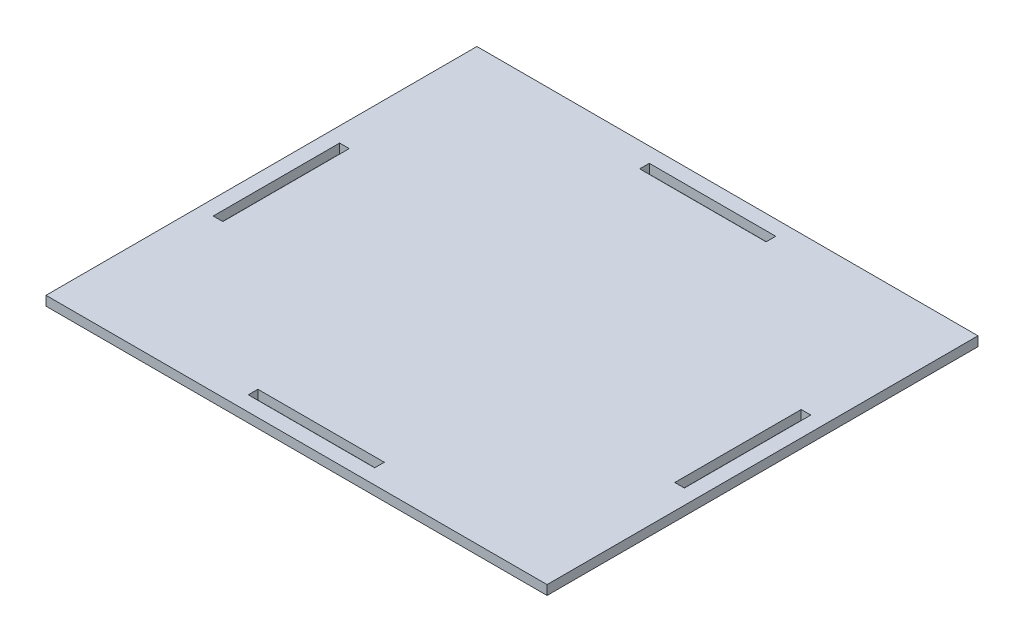
ISO-10303-21;
HEADER;
FILE_DESCRIPTION(('STEP AP214'),'2;1');
FILE_NAME('part.step','',(''),(''),'','','');
FILE_SCHEMA(('AUTOMOTIVE_DESIGN { 1 0 10303 214 1 1 1 1 }'));
ENDSEC;
DATA;
#1=APPLICATION_CONTEXT('core data for automotive mechanical design processes');
#2=APPLICATION_PROTOCOL_DEFINITION('international standard','automotive_design',2000,#1);
#3=PRODUCT_CONTEXT('',#1,'mechanical');
#4=PRODUCT('Part','Part','',(#3));
#5=PRODUCT_RELATED_PRODUCT_CATEGORY('part','',(#4));
#6=PRODUCT_DEFINITION_FORMATION('','',#4);
#7=PRODUCT_DEFINITION_CONTEXT('part definition',#1,'design');
#8=PRODUCT_DEFINITION('design','',#6,#7);
#9=PRODUCT_DEFINITION_SHAPE('','',#8);
#10=(LENGTH_UNIT() NAMED_UNIT(*) SI_UNIT(.MILLI.,.METRE.));
#11=(NAMED_UNIT(*) PLANE_ANGLE_UNIT() SI_UNIT($,.RADIAN.));
#12=(NAMED_UNIT(*) SI_UNIT($,.STERADIAN.) SOLID_ANGLE_UNIT());
#13=UNCERTAINTY_MEASURE_WITH_UNIT(LENGTH_MEASURE(1.E-05),#10,'distance_accuracy_value','');
#14=(GEOMETRIC_REPRESENTATION_CONTEXT(3) GLOBAL_UNCERTAINTY_ASSIGNED_CONTEXT((#13)) GLOBAL_UNIT_ASSIGNED_CONTEXT((#10,
#11,#12)) REPRESENTATION_CONTEXT('',''));
#15=CARTESIAN_POINT('',(0.,0.,0.));
#16=DIRECTION('',(0.,0.,1.));
#17=DIRECTION('',(1.,0.,0.));
#18=AXIS2_PLACEMENT_3D('',#15,#16,#17);
#19=CARTESIAN_POINT('',(79.375,1.4986,68.2625));
#20=DIRECTION('',(-1.,0.,0.));
#21=DIRECTION('',(0.,0.,1.));
#22=AXIS2_PLACEMENT_3D('',#19,#20,#21);
#23=PLANE('',#22);
#24=DIRECTION('',(0.,0.,-1.));
#25=VECTOR('',#24,1.);
#26=CARTESIAN_POINT('',(79.375,-1.4986,68.2625));
#27=LINE('',#26,#25);
#28=CARTESIAN_POINT('',(79.375,-1.4986,68.2625));
#29=VERTEX_POINT('',#28);
#30=CARTESIAN_POINT('',(79.375,-1.4986,-68.2625));
#31=VERTEX_POINT('',#30);
#32=EDGE_CURVE('E294',#29,#31,#27,.T.);
#33=ORIENTED_EDGE('',*,*,#32,.T.);
#34=DIRECTION('',(0.,-1.,0.));
#35=VECTOR('',#34,1.);
#36=CARTESIAN_POINT('',(79.375,1.4986,-68.2625));
#37=LINE('',#36,#35);
#38=CARTESIAN_POINT('',(79.375,1.4986,-68.2625));
#39=VERTEX_POINT('',#38);
#40=EDGE_CURVE('E11',#39,#31,#37,.T.);
#41=ORIENTED_EDGE('',*,*,#40,.F.);
#42=DIRECTION('',(0.,0.,-1.));
#43=VECTOR('',#42,1.);
#44=CARTESIAN_POINT('',(79.375,1.4986,68.2625));
#45=LINE('',#44,#43);
#46=CARTESIAN_POINT('',(79.375,1.4986,68.2625));
#47=VERTEX_POINT('',#46);
#48=EDGE_CURVE('E301',#47,#39,#45,.T.);
#49=ORIENTED_EDGE('',*,*,#48,.F.);
#50=DIRECTION('',(0.,-1.,0.));
#51=VECTOR('',#50,1.);
#52=CARTESIAN_POINT('',(79.375,1.4986,68.2625));
#53=LINE('',#52,#51);
#54=EDGE_CURVE('E311',#47,#29,#53,.T.);
#55=ORIENTED_EDGE('',*,*,#54,.T.);
#56=EDGE_LOOP('',(#33,#41,#49,#55));
#57=FACE_BOUND('',#56,.T.);
#58=ADVANCED_FACE('F32',(#57),#23,.F.);
#59=CARTESIAN_POINT('',(-79.375,1.4986,-68.2625));
#60=DIRECTION('',(0.,0.,1.));
#61=DIRECTION('',(1.,0.,0.));
#62=AXIS2_PLACEMENT_3D('',#59,#60,#61);
#63=PLANE('',#62);
#64=DIRECTION('',(-1.,0.,0.));
#65=VECTOR('',#64,1.);
#66=CARTESIAN_POINT('',(-79.375,-1.4986,-68.2625));
#67=LINE('',#66,#65);
#68=CARTESIAN_POINT('',(-79.375,-1.4986,-68.2625));
#69=VERTEX_POINT('',#68);
#70=EDGE_CURVE('E314',#31,#69,#67,.T.);
#71=ORIENTED_EDGE('',*,*,#70,.T.);
#72=DIRECTION('',(0.,-1.,0.));
#73=VECTOR('',#72,1.);
#74=CARTESIAN_POINT('',(-79.375,1.4986,-68.2625));
#75=LINE('',#74,#73);
#76=CARTESIAN_POINT('',(-79.375,1.4986,-68.2625));
#77=VERTEX_POINT('',#76);
#78=EDGE_CURVE('E39',#77,#69,#75,.T.);
#79=ORIENTED_EDGE('',*,*,#78,.F.);
#80=DIRECTION('',(-1.,0.,0.));
#81=VECTOR('',#80,1.);
#82=CARTESIAN_POINT('',(-79.375,1.4986,-68.2625));
#83=LINE('',#82,#81);
#84=EDGE_CURVE('E304',#39,#77,#83,.T.);
#85=ORIENTED_EDGE('',*,*,#84,.F.);
#86=ORIENTED_EDGE('',*,*,#40,.T.);
#87=EDGE_LOOP('',(#71,#79,#85,#86));
#88=FACE_BOUND('',#87,.T.);
#89=ADVANCED_FACE('F343',(#88),#63,.F.);
#90=CARTESIAN_POINT('',(-79.375,1.4986,68.2625));
#91=DIRECTION('',(1.,0.,0.));
#92=DIRECTION('',(0.,0.,-1.));
#93=AXIS2_PLACEMENT_3D('',#90,#91,#92);
#94=PLANE('',#93);
#95=DIRECTION('',(0.,0.,1.));
#96=VECTOR('',#95,1.);
#97=CARTESIAN_POINT('',(-79.375,-1.4986,68.2625));
#98=LINE('',#97,#96);
#99=CARTESIAN_POINT('',(-79.375,-1.4986,68.2625));
#100=VERTEX_POINT('',#99);
#101=EDGE_CURVE('E316',#69,#100,#98,.T.);
#102=ORIENTED_EDGE('',*,*,#101,.T.);
#103=DIRECTION('',(0.,-1.,0.));
#104=VECTOR('',#103,1.);
#105=CARTESIAN_POINT('',(-79.375,1.4986,68.2625));
#106=LINE('',#105,#104);
#107=CARTESIAN_POINT('',(-79.375,1.4986,68.2625));
#108=VERTEX_POINT('',#107);
#109=EDGE_CURVE('E321',#108,#100,#106,.T.);
#110=ORIENTED_EDGE('',*,*,#109,.F.);
#111=DIRECTION('',(0.,0.,1.));
#112=VECTOR('',#111,1.);
#113=CARTESIAN_POINT('',(-79.375,1.4986,68.2625));
#114=LINE('',#113,#112);
#115=EDGE_CURVE('E307',#77,#108,#114,.T.);
#116=ORIENTED_EDGE('',*,*,#115,.F.);
#117=ORIENTED_EDGE('',*,*,#78,.T.);
#118=EDGE_LOOP('',(#102,#110,#116,#117));
#119=FACE_BOUND('',#118,.T.);
#120=ADVANCED_FACE('F328',(#119),#94,.F.);
#121=CARTESIAN_POINT('',(-79.375,1.4986,68.2625));
#122=DIRECTION('',(0.,0.,-1.));
#123=DIRECTION('',(-1.,0.,0.));
#124=AXIS2_PLACEMENT_3D('',#121,#122,#123);
#125=PLANE('',#124);
#126=DIRECTION('',(1.,0.,0.));
#127=VECTOR('',#126,1.);
#128=CARTESIAN_POINT('',(-79.375,-1.4986,68.2625));
#129=LINE('',#128,#127);
#130=EDGE_CURVE('E305',#100,#29,#129,.T.);
#131=ORIENTED_EDGE('',*,*,#130,.T.);
#132=ORIENTED_EDGE('',*,*,#54,.F.);
#133=DIRECTION('',(1.,0.,0.));
#134=VECTOR('',#133,1.);
#135=CARTESIAN_POINT('',(-79.375,1.4986,68.2625));
#136=LINE('',#135,#134);
#137=EDGE_CURVE('E309',#108,#47,#136,.T.);
#138=ORIENTED_EDGE('',*,*,#137,.F.);
#139=ORIENTED_EDGE('',*,*,#109,.T.);
#140=EDGE_LOOP('',(#131,#132,#138,#139));
#141=FACE_BOUND('',#140,.T.);
#142=ADVANCED_FACE('F336',(#141),#125,.F.);
#143=CARTESIAN_POINT('',(79.3749999999999,1.4986,-68.2625));
#144=DIRECTION('',(0.,-1.,0.));
#145=DIRECTION('',(0.,0.,-1.));
#146=AXIS2_PLACEMENT_3D('',#143,#144,#145);
#147=PLANE('',#146);
#148=DIRECTION('',(0.,0.,1.));
#149=VECTOR('',#148,1.);
#150=CARTESIAN_POINT('',(71.5899,1.4986,-20.0254));
#151=LINE('',#150,#149);
#152=CARTESIAN_POINT('',(71.5899,1.4986,-20.0254));
#153=VERTEX_POINT('',#152);
#154=CARTESIAN_POINT('',(71.5899,1.4986,20.0254));
#155=VERTEX_POINT('',#154);
#156=EDGE_CURVE('E195',#153,#155,#151,.T.);
#157=ORIENTED_EDGE('',*,*,#156,.F.);
#158=DIRECTION('',(-1.,0.,0.));
#159=VECTOR('',#158,1.);
#160=CARTESIAN_POINT('',(74.6379,1.4986,-20.0254));
#161=LINE('',#160,#159);
#162=CARTESIAN_POINT('',(74.6379,1.4986,-20.0254));
#163=VERTEX_POINT('',#162);
#164=EDGE_CURVE('E46',#163,#153,#161,.T.);
#165=ORIENTED_EDGE('',*,*,#164,.F.);
#166=DIRECTION('',(0.,0.,-1.));
#167=VECTOR('',#166,1.);
#168=CARTESIAN_POINT('',(74.6379,1.4986,-20.0254));
#169=LINE('',#168,#167);
#170=CARTESIAN_POINT('',(74.6379,1.4986,20.0254));
#171=VERTEX_POINT('',#170);
#172=EDGE_CURVE('E186',#171,#163,#169,.T.);
#173=ORIENTED_EDGE('',*,*,#172,.F.);
#174=DIRECTION('',(1.,0.,0.));
#175=VECTOR('',#174,1.);
#176=CARTESIAN_POINT('',(74.6379,1.4986,20.0254));
#177=LINE('',#176,#175);
#178=EDGE_CURVE('E189',#155,#171,#177,.T.);
#179=ORIENTED_EDGE('',*,*,#178,.F.);
#180=EDGE_LOOP('',(#157,#165,#173,#179));
#181=FACE_BOUND('',#180,.T.);
#182=DIRECTION('',(0.,0.,-1.));
#183=VECTOR('',#182,1.);
#184=CARTESIAN_POINT('',(20.0254,1.4986,63.5254));
#185=LINE('',#184,#183);
#186=CARTESIAN_POINT('',(20.0254,1.4986,63.5254));
#187=VERTEX_POINT('',#186);
#188=CARTESIAN_POINT('',(20.0254,1.4986,60.4774));
#189=VERTEX_POINT('',#188);
#190=EDGE_CURVE('E220',#187,#189,#185,.T.);
#191=ORIENTED_EDGE('',*,*,#190,.F.);
#192=DIRECTION('',(1.,0.,0.));
#193=VECTOR('',#192,1.);
#194=CARTESIAN_POINT('',(-20.0254,1.4986,63.5254));
#195=LINE('',#194,#193);
#196=CARTESIAN_POINT('',(-20.0254,1.4986,63.5254));
#197=VERTEX_POINT('',#196);
#198=EDGE_CURVE('E201',#197,#187,#195,.T.);
#199=ORIENTED_EDGE('',*,*,#198,.F.);
#200=DIRECTION('',(0.,0.,1.));
#201=VECTOR('',#200,1.);
#202=CARTESIAN_POINT('',(-20.0254,1.4986,63.5254));
#203=LINE('',#202,#201);
#204=CARTESIAN_POINT('',(-20.0254,1.4986,60.4774));
#205=VERTEX_POINT('',#204);
#206=EDGE_CURVE('E209',#205,#197,#203,.T.);
#207=ORIENTED_EDGE('',*,*,#206,.F.);
#208=DIRECTION('',(-1.,0.,0.));
#209=VECTOR('',#208,1.);
#210=CARTESIAN_POINT('',(-20.0254,1.4986,60.4774));
#211=LINE('',#210,#209);
#212=EDGE_CURVE('E223',#189,#205,#211,.T.);
#213=ORIENTED_EDGE('',*,*,#212,.F.);
#214=EDGE_LOOP('',(#191,#199,#207,#213));
#215=FACE_BOUND('',#214,.T.);
#216=DIRECTION('',(1.,0.,0.));
#217=VECTOR('',#216,1.);
#218=CARTESIAN_POINT('',(-74.6379,1.4986,20.0254));
#219=LINE('',#218,#217);
#220=CARTESIAN_POINT('',(-74.6379,1.4986,20.0254));
#221=VERTEX_POINT('',#220);
#222=CARTESIAN_POINT('',(-71.5899,1.4986,20.0254));
#223=VERTEX_POINT('',#222);
#224=EDGE_CURVE('E252',#221,#223,#219,.T.);
#225=ORIENTED_EDGE('',*,*,#224,.F.);
#226=DIRECTION('',(0.,0.,1.));
#227=VECTOR('',#226,1.);
#228=CARTESIAN_POINT('',(-74.6379,1.4986,-20.0254));
#229=LINE('',#228,#227);
#230=CARTESIAN_POINT('',(-74.6379,1.4986,-20.0254));
#231=VERTEX_POINT('',#230);
#232=EDGE_CURVE('E230',#231,#221,#229,.T.);
#233=ORIENTED_EDGE('',*,*,#232,.F.);
#234=DIRECTION('',(-1.,0.,0.));
#235=VECTOR('',#234,1.);
#236=CARTESIAN_POINT('',(-74.6379,1.4986,-20.0254));
#237=LINE('',#236,#235);
#238=CARTESIAN_POINT('',(-71.5899,1.4986,-20.0254));
#239=VERTEX_POINT('',#238);
#240=EDGE_CURVE('E241',#239,#231,#237,.T.);
#241=ORIENTED_EDGE('',*,*,#240,.F.);
#242=DIRECTION('',(0.,0.,-1.));
#243=VECTOR('',#242,1.);
#244=CARTESIAN_POINT('',(-71.5899,1.4986,-20.0254));
#245=LINE('',#244,#243);
#246=EDGE_CURVE('E255',#223,#239,#245,.T.);
#247=ORIENTED_EDGE('',*,*,#246,.F.);
#248=EDGE_LOOP('',(#225,#233,#241,#247));
#249=FACE_BOUND('',#248,.T.);
#250=DIRECTION('',(1.,0.,0.));
#251=VECTOR('',#250,1.);
#252=CARTESIAN_POINT('',(-20.0254,1.4986,-60.4774));
#253=LINE('',#252,#251);
#254=CARTESIAN_POINT('',(-20.0254,1.4986,-60.4774));
#255=VERTEX_POINT('',#254);
#256=CARTESIAN_POINT('',(20.0254,1.4986,-60.4774));
#257=VERTEX_POINT('',#256);
#258=EDGE_CURVE('E284',#255,#257,#253,.T.);
#259=ORIENTED_EDGE('',*,*,#258,.F.);
#260=DIRECTION('',(0.,0.,1.));
#261=VECTOR('',#260,1.);
#262=CARTESIAN_POINT('',(-20.0254,1.4986,-63.5254));
#263=LINE('',#262,#261);
#264=CARTESIAN_POINT('',(-20.0254,1.4986,-63.5254));
#265=VERTEX_POINT('',#264);
#266=EDGE_CURVE('E262',#265,#255,#263,.T.);
#267=ORIENTED_EDGE('',*,*,#266,.F.);
#268=DIRECTION('',(-1.,0.,0.));
#269=VECTOR('',#268,1.);
#270=CARTESIAN_POINT('',(-20.0254,1.4986,-63.5254));
#271=LINE('',#270,#269);
#272=CARTESIAN_POINT('',(20.0254,1.4986,-63.5254));
#273=VERTEX_POINT('',#272);
#274=EDGE_CURVE('E273',#273,#265,#271,.T.);
#275=ORIENTED_EDGE('',*,*,#274,.F.);
#276=DIRECTION('',(0.,0.,-1.));
#277=VECTOR('',#276,1.);
#278=CARTESIAN_POINT('',(20.0254,1.4986,-63.5254));
#279=LINE('',#278,#277);
#280=EDGE_CURVE('E287',#257,#273,#279,.T.);
#281=ORIENTED_EDGE('',*,*,#280,.F.);
#282=EDGE_LOOP('',(#259,#267,#275,#281));
#283=FACE_BOUND('',#282,.T.);
#284=ORIENTED_EDGE('',*,*,#48,.T.);
#285=ORIENTED_EDGE('',*,*,#84,.T.);
#286=ORIENTED_EDGE('',*,*,#115,.T.);
#287=ORIENTED_EDGE('',*,*,#137,.T.);
#288=EDGE_LOOP('',(#284,#285,#286,#287));
#289=FACE_BOUND('',#288,.T.);
#290=ADVANCED_FACE('F342',(#181,#215,#249,#283,#289),#147,.F.);
#291=CARTESIAN_POINT('',(79.3749999999999,-1.4986,-68.2625));
#292=DIRECTION('',(0.,-1.,0.));
#293=DIRECTION('',(0.,0.,-1.));
#294=AXIS2_PLACEMENT_3D('',#291,#292,#293);
#295=PLANE('',#294);
#296=DIRECTION('',(-1.,0.,0.));
#297=VECTOR('',#296,1.);
#298=CARTESIAN_POINT('',(74.6379,-1.4986,-20.0254));
#299=LINE('',#298,#297);
#300=CARTESIAN_POINT('',(74.6379,-1.4986,-20.0254));
#301=VERTEX_POINT('',#300);
#302=CARTESIAN_POINT('',(71.5899,-1.4986,-20.0254));
#303=VERTEX_POINT('',#302);
#304=EDGE_CURVE('E170',#301,#303,#299,.T.);
#305=ORIENTED_EDGE('',*,*,#304,.T.);
#306=DIRECTION('',(0.,0.,1.));
#307=VECTOR('',#306,1.);
#308=CARTESIAN_POINT('',(71.5899,-1.4986,-20.0254));
#309=LINE('',#308,#307);
#310=CARTESIAN_POINT('',(71.5899,-1.4986,20.0254));
#311=VERTEX_POINT('',#310);
#312=EDGE_CURVE('E179',#303,#311,#309,.T.);
#313=ORIENTED_EDGE('',*,*,#312,.T.);
#314=DIRECTION('',(1.,0.,0.));
#315=VECTOR('',#314,1.);
#316=CARTESIAN_POINT('',(74.6379,-1.4986,20.0254));
#317=LINE('',#316,#315);
#318=CARTESIAN_POINT('',(74.6379,-1.4986,20.0254));
#319=VERTEX_POINT('',#318);
#320=EDGE_CURVE('E54',#311,#319,#317,.T.);
#321=ORIENTED_EDGE('',*,*,#320,.T.);
#322=DIRECTION('',(0.,0.,-1.));
#323=VECTOR('',#322,1.);
#324=CARTESIAN_POINT('',(74.6379,-1.4986,-20.0254));
#325=LINE('',#324,#323);
#326=EDGE_CURVE('E176',#319,#301,#325,.T.);
#327=ORIENTED_EDGE('',*,*,#326,.T.);
#328=EDGE_LOOP('',(#305,#313,#321,#327));
#329=FACE_BOUND('',#328,.T.);
#330=DIRECTION('',(1.,0.,0.));
#331=VECTOR('',#330,1.);
#332=CARTESIAN_POINT('',(-20.0254,-1.4986,63.5254));
#333=LINE('',#332,#331);
#334=CARTESIAN_POINT('',(-20.0254,-1.4986,63.5254));
#335=VERTEX_POINT('',#334);
#336=CARTESIAN_POINT('',(20.0254,-1.4986,63.5254));
#337=VERTEX_POINT('',#336);
#338=EDGE_CURVE('E205',#335,#337,#333,.T.);
#339=ORIENTED_EDGE('',*,*,#338,.T.);
#340=DIRECTION('',(0.,0.,-1.));
#341=VECTOR('',#340,1.);
#342=CARTESIAN_POINT('',(20.0254,-1.4986,63.5254));
#343=LINE('',#342,#341);
#344=CARTESIAN_POINT('',(20.0254,-1.4986,60.4774));
#345=VERTEX_POINT('',#344);
#346=EDGE_CURVE('E208',#337,#345,#343,.T.);
#347=ORIENTED_EDGE('',*,*,#346,.T.);
#348=DIRECTION('',(-1.,0.,0.));
#349=VECTOR('',#348,1.);
#350=CARTESIAN_POINT('',(-20.0254,-1.4986,60.4774));
#351=LINE('',#350,#349);
#352=CARTESIAN_POINT('',(-20.0254,-1.4986,60.4774));
#353=VERTEX_POINT('',#352);
#354=EDGE_CURVE('E212',#345,#353,#351,.T.);
#355=ORIENTED_EDGE('',*,*,#354,.T.);
#356=DIRECTION('',(0.,0.,1.));
#357=VECTOR('',#356,1.);
#358=CARTESIAN_POINT('',(-20.0254,-1.4986,63.5254));
#359=LINE('',#358,#357);
#360=EDGE_CURVE('E215',#353,#335,#359,.T.);
#361=ORIENTED_EDGE('',*,*,#360,.T.);
#362=EDGE_LOOP('',(#339,#347,#355,#361));
#363=FACE_BOUND('',#362,.T.);
#364=DIRECTION('',(0.,0.,1.));
#365=VECTOR('',#364,1.);
#366=CARTESIAN_POINT('',(-74.6379,-1.4986,-20.0254));
#367=LINE('',#366,#365);
#368=CARTESIAN_POINT('',(-74.6379,-1.4986,-20.0254));
#369=VERTEX_POINT('',#368);
#370=CARTESIAN_POINT('',(-74.6379,-1.4986,20.0254));
#371=VERTEX_POINT('',#370);
#372=EDGE_CURVE('E237',#369,#371,#367,.T.);
#373=ORIENTED_EDGE('',*,*,#372,.T.);
#374=DIRECTION('',(1.,0.,0.));
#375=VECTOR('',#374,1.);
#376=CARTESIAN_POINT('',(-74.6379,-1.4986,20.0254));
#377=LINE('',#376,#375);
#378=CARTESIAN_POINT('',(-71.5899,-1.4986,20.0254));
#379=VERTEX_POINT('',#378);
#380=EDGE_CURVE('E240',#371,#379,#377,.T.);
#381=ORIENTED_EDGE('',*,*,#380,.T.);
#382=DIRECTION('',(0.,0.,-1.));
#383=VECTOR('',#382,1.);
#384=CARTESIAN_POINT('',(-71.5899,-1.4986,-20.0254));
#385=LINE('',#384,#383);
#386=CARTESIAN_POINT('',(-71.5899,-1.4986,-20.0254));
#387=VERTEX_POINT('',#386);
#388=EDGE_CURVE('E244',#379,#387,#385,.T.);
#389=ORIENTED_EDGE('',*,*,#388,.T.);
#390=DIRECTION('',(-1.,0.,0.));
#391=VECTOR('',#390,1.);
#392=CARTESIAN_POINT('',(-74.6379,-1.4986,-20.0254));
#393=LINE('',#392,#391);
#394=EDGE_CURVE('E247',#387,#369,#393,.T.);
#395=ORIENTED_EDGE('',*,*,#394,.T.);
#396=EDGE_LOOP('',(#373,#381,#389,#395));
#397=FACE_BOUND('',#396,.T.);
#398=DIRECTION('',(0.,0.,1.));
#399=VECTOR('',#398,1.);
#400=CARTESIAN_POINT('',(-20.0254,-1.4986,-63.5254));
#401=LINE('',#400,#399);
#402=CARTESIAN_POINT('',(-20.0254,-1.4986,-63.5254));
#403=VERTEX_POINT('',#402);
#404=CARTESIAN_POINT('',(-20.0254,-1.4986,-60.4774));
#405=VERTEX_POINT('',#404);
#406=EDGE_CURVE('E269',#403,#405,#401,.T.);
#407=ORIENTED_EDGE('',*,*,#406,.T.);
#408=DIRECTION('',(1.,0.,0.));
#409=VECTOR('',#408,1.);
#410=CARTESIAN_POINT('',(-20.0254,-1.4986,-60.4774));
#411=LINE('',#410,#409);
#412=CARTESIAN_POINT('',(20.0254,-1.4986,-60.4774));
#413=VERTEX_POINT('',#412);
#414=EDGE_CURVE('E272',#405,#413,#411,.T.);
#415=ORIENTED_EDGE('',*,*,#414,.T.);
#416=DIRECTION('',(0.,0.,-1.));
#417=VECTOR('',#416,1.);
#418=CARTESIAN_POINT('',(20.0254,-1.4986,-63.5254));
#419=LINE('',#418,#417);
#420=CARTESIAN_POINT('',(20.0254,-1.4986,-63.5254));
#421=VERTEX_POINT('',#420);
#422=EDGE_CURVE('E276',#413,#421,#419,.T.);
#423=ORIENTED_EDGE('',*,*,#422,.T.);
#424=DIRECTION('',(-1.,0.,0.));
#425=VECTOR('',#424,1.);
#426=CARTESIAN_POINT('',(-20.0254,-1.4986,-63.5254));
#427=LINE('',#426,#425);
#428=EDGE_CURVE('E279',#421,#403,#427,.T.);
#429=ORIENTED_EDGE('',*,*,#428,.T.);
#430=EDGE_LOOP('',(#407,#415,#423,#429));
#431=FACE_BOUND('',#430,.T.);
#432=ORIENTED_EDGE('',*,*,#32,.F.);
#433=ORIENTED_EDGE('',*,*,#130,.F.);
#434=ORIENTED_EDGE('',*,*,#101,.F.);
#435=ORIENTED_EDGE('',*,*,#70,.F.);
#436=EDGE_LOOP('',(#432,#433,#434,#435));
#437=FACE_BOUND('',#436,.T.);
#438=ADVANCED_FACE('F183',(#329,#363,#397,#431,#437),#295,.T.);
#439=CARTESIAN_POINT('',(-20.0254,-1.4986,-63.5254));
#440=DIRECTION('',(-1.,0.,0.));
#441=DIRECTION('',(0.,0.,1.));
#442=AXIS2_PLACEMENT_3D('',#439,#440,#441);
#443=PLANE('',#442);
#444=ORIENTED_EDGE('',*,*,#266,.T.);
#445=DIRECTION('',(0.,1.,0.));
#446=VECTOR('',#445,1.);
#447=CARTESIAN_POINT('',(-20.0254,-1.4986,-60.4774));
#448=LINE('',#447,#446);
#449=EDGE_CURVE('E282',#405,#255,#448,.T.);
#450=ORIENTED_EDGE('',*,*,#449,.F.);
#451=ORIENTED_EDGE('',*,*,#406,.F.);
#452=DIRECTION('',(0.,1.,0.));
#453=VECTOR('',#452,1.);
#454=CARTESIAN_POINT('',(-20.0254,-1.4986,-63.5254));
#455=LINE('',#454,#453);
#456=EDGE_CURVE('E292',#403,#265,#455,.T.);
#457=ORIENTED_EDGE('',*,*,#456,.T.);
#458=EDGE_LOOP('',(#444,#450,#451,#457));
#459=FACE_BOUND('',#458,.T.);
#460=ADVANCED_FACE('F355',(#459),#443,.F.);
#461=CARTESIAN_POINT('',(-20.0254,-1.4986,-63.5254));
#462=DIRECTION('',(0.,0.,-1.));
#463=DIRECTION('',(-1.,0.,0.));
#464=AXIS2_PLACEMENT_3D('',#461,#462,#463);
#465=PLANE('',#464);
#466=ORIENTED_EDGE('',*,*,#274,.T.);
#467=ORIENTED_EDGE('',*,*,#456,.F.);
#468=ORIENTED_EDGE('',*,*,#428,.F.);
#469=DIRECTION('',(0.,1.,0.));
#470=VECTOR('',#469,1.);
#471=CARTESIAN_POINT('',(20.0254,-1.4986,-63.5254));
#472=LINE('',#471,#470);
#473=EDGE_CURVE('E295',#421,#273,#472,.T.);
#474=ORIENTED_EDGE('',*,*,#473,.T.);
#475=EDGE_LOOP('',(#466,#467,#468,#474));
#476=FACE_BOUND('',#475,.T.);
#477=ADVANCED_FACE('F361',(#476),#465,.F.);
#478=CARTESIAN_POINT('',(20.0254,-1.4986,-63.5254));
#479=DIRECTION('',(1.,0.,0.));
#480=DIRECTION('',(0.,0.,-1.));
#481=AXIS2_PLACEMENT_3D('',#478,#479,#480);
#482=PLANE('',#481);
#483=ORIENTED_EDGE('',*,*,#280,.T.);
#484=ORIENTED_EDGE('',*,*,#473,.F.);
#485=ORIENTED_EDGE('',*,*,#422,.F.);
#486=DIRECTION('',(0.,1.,0.));
#487=VECTOR('',#486,1.);
#488=CARTESIAN_POINT('',(20.0254,-1.4986,-60.4774));
#489=LINE('',#488,#487);
#490=EDGE_CURVE('E297',#413,#257,#489,.T.);
#491=ORIENTED_EDGE('',*,*,#490,.T.);
#492=EDGE_LOOP('',(#483,#484,#485,#491));
#493=FACE_BOUND('',#492,.T.);
#494=ADVANCED_FACE('F367',(#493),#482,.F.);
#495=CARTESIAN_POINT('',(-20.0254,-1.4986,-60.4774));
#496=DIRECTION('',(0.,0.,1.));
#497=DIRECTION('',(1.,0.,0.));
#498=AXIS2_PLACEMENT_3D('',#495,#496,#497);
#499=PLANE('',#498);
#500=ORIENTED_EDGE('',*,*,#258,.T.);
#501=ORIENTED_EDGE('',*,*,#490,.F.);
#502=ORIENTED_EDGE('',*,*,#414,.F.);
#503=ORIENTED_EDGE('',*,*,#449,.T.);
#504=EDGE_LOOP('',(#500,#501,#502,#503));
#505=FACE_BOUND('',#504,.T.);
#506=ADVANCED_FACE('F363',(#505),#499,.F.);
#507=CARTESIAN_POINT('',(-74.6379,-1.4986,-20.0254));
#508=DIRECTION('',(-1.,0.,0.));
#509=DIRECTION('',(0.,0.,1.));
#510=AXIS2_PLACEMENT_3D('',#507,#508,#509);
#511=PLANE('',#510);
#512=ORIENTED_EDGE('',*,*,#232,.T.);
#513=DIRECTION('',(0.,1.,0.));
#514=VECTOR('',#513,1.);
#515=CARTESIAN_POINT('',(-74.6379,-1.4986,20.0254));
#516=LINE('',#515,#514);
#517=EDGE_CURVE('E250',#371,#221,#516,.T.);
#518=ORIENTED_EDGE('',*,*,#517,.F.);
#519=ORIENTED_EDGE('',*,*,#372,.F.);
#520=DIRECTION('',(0.,1.,0.));
#521=VECTOR('',#520,1.);
#522=CARTESIAN_POINT('',(-74.6379,-1.4986,-20.0254));
#523=LINE('',#522,#521);
#524=EDGE_CURVE('E260',#369,#231,#523,.T.);
#525=ORIENTED_EDGE('',*,*,#524,.T.);
#526=EDGE_LOOP('',(#512,#518,#519,#525));
#527=FACE_BOUND('',#526,.T.);
#528=ADVANCED_FACE('F366',(#527),#511,.F.);
#529=CARTESIAN_POINT('',(-74.6379,-1.4986,-20.0254));
#530=DIRECTION('',(0.,0.,-1.));
#531=DIRECTION('',(-1.,0.,0.));
#532=AXIS2_PLACEMENT_3D('',#529,#530,#531);
#533=PLANE('',#532);
#534=ORIENTED_EDGE('',*,*,#240,.T.);
#535=ORIENTED_EDGE('',*,*,#524,.F.);
#536=ORIENTED_EDGE('',*,*,#394,.F.);
#537=DIRECTION('',(0.,1.,0.));
#538=VECTOR('',#537,1.);
#539=CARTESIAN_POINT('',(-71.5899,-1.4986,-20.0254));
#540=LINE('',#539,#538);
#541=EDGE_CURVE('E263',#387,#239,#540,.T.);
#542=ORIENTED_EDGE('',*,*,#541,.T.);
#543=EDGE_LOOP('',(#534,#535,#536,#542));
#544=FACE_BOUND('',#543,.T.);
#545=ADVANCED_FACE('F377',(#544),#533,.F.);
#546=CARTESIAN_POINT('',(-71.5899,-1.4986,-20.0254));
#547=DIRECTION('',(1.,0.,0.));
#548=DIRECTION('',(0.,0.,-1.));
#549=AXIS2_PLACEMENT_3D('',#546,#547,#548);
#550=PLANE('',#549);
#551=ORIENTED_EDGE('',*,*,#246,.T.);
#552=ORIENTED_EDGE('',*,*,#541,.F.);
#553=ORIENTED_EDGE('',*,*,#388,.F.);
#554=DIRECTION('',(0.,1.,0.));
#555=VECTOR('',#554,1.);
#556=CARTESIAN_POINT('',(-71.5899,-1.4986,20.0254));
#557=LINE('',#556,#555);
#558=EDGE_CURVE('E265',#379,#223,#557,.T.);
#559=ORIENTED_EDGE('',*,*,#558,.T.);
#560=EDGE_LOOP('',(#551,#552,#553,#559));
#561=FACE_BOUND('',#560,.T.);
#562=ADVANCED_FACE('F383',(#561),#550,.F.);
#563=CARTESIAN_POINT('',(-74.6379,-1.4986,20.0254));
#564=DIRECTION('',(0.,0.,1.));
#565=DIRECTION('',(1.,0.,0.));
#566=AXIS2_PLACEMENT_3D('',#563,#564,#565);
#567=PLANE('',#566);
#568=ORIENTED_EDGE('',*,*,#224,.T.);
#569=ORIENTED_EDGE('',*,*,#558,.F.);
#570=ORIENTED_EDGE('',*,*,#380,.F.);
#571=ORIENTED_EDGE('',*,*,#517,.T.);
#572=EDGE_LOOP('',(#568,#569,#570,#571));
#573=FACE_BOUND('',#572,.T.);
#574=ADVANCED_FACE('F379',(#573),#567,.F.);
#575=CARTESIAN_POINT('',(-20.0254,-1.4986,63.5254));
#576=DIRECTION('',(0.,0.,1.));
#577=DIRECTION('',(1.,0.,0.));
#578=AXIS2_PLACEMENT_3D('',#575,#576,#577);
#579=PLANE('',#578);
#580=ORIENTED_EDGE('',*,*,#198,.T.);
#581=DIRECTION('',(0.,1.,0.));
#582=VECTOR('',#581,1.);
#583=CARTESIAN_POINT('',(20.0254,-1.4986,63.5254));
#584=LINE('',#583,#582);
#585=EDGE_CURVE('E218',#337,#187,#584,.T.);
#586=ORIENTED_EDGE('',*,*,#585,.F.);
#587=ORIENTED_EDGE('',*,*,#338,.F.);
#588=DIRECTION('',(0.,1.,0.));
#589=VECTOR('',#588,1.);
#590=CARTESIAN_POINT('',(-20.0254,-1.4986,63.5254));
#591=LINE('',#590,#589);
#592=EDGE_CURVE('E228',#335,#197,#591,.T.);
#593=ORIENTED_EDGE('',*,*,#592,.T.);
#594=EDGE_LOOP('',(#580,#586,#587,#593));
#595=FACE_BOUND('',#594,.T.);
#596=ADVANCED_FACE('F382',(#595),#579,.F.);
#597=CARTESIAN_POINT('',(-20.0254,-1.4986,63.5254));
#598=DIRECTION('',(-1.,0.,0.));
#599=DIRECTION('',(0.,0.,1.));
#600=AXIS2_PLACEMENT_3D('',#597,#598,#599);
#601=PLANE('',#600);
#602=ORIENTED_EDGE('',*,*,#206,.T.);
#603=ORIENTED_EDGE('',*,*,#592,.F.);
#604=ORIENTED_EDGE('',*,*,#360,.F.);
#605=DIRECTION('',(0.,1.,0.));
#606=VECTOR('',#605,1.);
#607=CARTESIAN_POINT('',(-20.0254,-1.4986,60.4774));
#608=LINE('',#607,#606);
#609=EDGE_CURVE('E231',#353,#205,#608,.T.);
#610=ORIENTED_EDGE('',*,*,#609,.T.);
#611=EDGE_LOOP('',(#602,#603,#604,#610));
#612=FACE_BOUND('',#611,.T.);
#613=ADVANCED_FACE('F393',(#612),#601,.F.);
#614=CARTESIAN_POINT('',(-20.0254,-1.4986,60.4774));
#615=DIRECTION('',(0.,0.,-1.));
#616=DIRECTION('',(-1.,0.,0.));
#617=AXIS2_PLACEMENT_3D('',#614,#615,#616);
#618=PLANE('',#617);
#619=ORIENTED_EDGE('',*,*,#212,.T.);
#620=ORIENTED_EDGE('',*,*,#609,.F.);
#621=ORIENTED_EDGE('',*,*,#354,.F.);
#622=DIRECTION('',(0.,1.,0.));
#623=VECTOR('',#622,1.);
#624=CARTESIAN_POINT('',(20.0254,-1.4986,60.4774));
#625=LINE('',#624,#623);
#626=EDGE_CURVE('E233',#345,#189,#625,.T.);
#627=ORIENTED_EDGE('',*,*,#626,.T.);
#628=EDGE_LOOP('',(#619,#620,#621,#627));
#629=FACE_BOUND('',#628,.T.);
#630=ADVANCED_FACE('F398',(#629),#618,.F.);
#631=CARTESIAN_POINT('',(20.0254,-1.4986,63.5254));
#632=DIRECTION('',(1.,0.,0.));
#633=DIRECTION('',(0.,0.,-1.));
#634=AXIS2_PLACEMENT_3D('',#631,#632,#633);
#635=PLANE('',#634);
#636=ORIENTED_EDGE('',*,*,#190,.T.);
#637=ORIENTED_EDGE('',*,*,#626,.F.);
#638=ORIENTED_EDGE('',*,*,#346,.F.);
#639=ORIENTED_EDGE('',*,*,#585,.T.);
#640=EDGE_LOOP('',(#636,#637,#638,#639));
#641=FACE_BOUND('',#640,.T.);
#642=ADVANCED_FACE('F395',(#641),#635,.F.);
#643=CARTESIAN_POINT('',(74.6379,-1.4986,-20.0254));
#644=DIRECTION('',(0.,0.,-1.));
#645=DIRECTION('',(-1.,0.,0.));
#646=AXIS2_PLACEMENT_3D('',#643,#644,#645);
#647=PLANE('',#646);
#648=ORIENTED_EDGE('',*,*,#164,.T.);
#649=DIRECTION('',(0.,1.,0.));
#650=VECTOR('',#649,1.);
#651=CARTESIAN_POINT('',(71.5899,-1.4986,-20.0254));
#652=LINE('',#651,#650);
#653=EDGE_CURVE('E166',#303,#153,#652,.T.);
#654=ORIENTED_EDGE('',*,*,#653,.F.);
#655=ORIENTED_EDGE('',*,*,#304,.F.);
#656=DIRECTION('',(0.,1.,0.));
#657=VECTOR('',#656,1.);
#658=CARTESIAN_POINT('',(74.6379,-1.4986,-20.0254));
#659=LINE('',#658,#657);
#660=EDGE_CURVE('E199',#301,#163,#659,.T.);
#661=ORIENTED_EDGE('',*,*,#660,.T.);
#662=EDGE_LOOP('',(#648,#654,#655,#661));
#663=FACE_BOUND('',#662,.T.);
#664=ADVANCED_FACE('F168',(#663),#647,.F.);
#665=CARTESIAN_POINT('',(74.6379,-1.4986,-20.0254));
#666=DIRECTION('',(1.,0.,0.));
#667=DIRECTION('',(0.,0.,-1.));
#668=AXIS2_PLACEMENT_3D('',#665,#666,#667);
#669=PLANE('',#668);
#670=ORIENTED_EDGE('',*,*,#172,.T.);
#671=ORIENTED_EDGE('',*,*,#660,.F.);
#672=ORIENTED_EDGE('',*,*,#326,.F.);
#673=DIRECTION('',(0.,1.,0.));
#674=VECTOR('',#673,1.);
#675=CARTESIAN_POINT('',(74.6379,-1.4986,20.0254));
#676=LINE('',#675,#674);
#677=EDGE_CURVE('E202',#319,#171,#676,.T.);
#678=ORIENTED_EDGE('',*,*,#677,.T.);
#679=EDGE_LOOP('',(#670,#671,#672,#678));
#680=FACE_BOUND('',#679,.T.);
#681=ADVANCED_FACE('F408',(#680),#669,.F.);
#682=CARTESIAN_POINT('',(74.6379,-1.4986,20.0254));
#683=DIRECTION('',(0.,0.,1.));
#684=DIRECTION('',(1.,0.,0.));
#685=AXIS2_PLACEMENT_3D('',#682,#683,#684);
#686=PLANE('',#685);
#687=ORIENTED_EDGE('',*,*,#178,.T.);
#688=ORIENTED_EDGE('',*,*,#677,.F.);
#689=ORIENTED_EDGE('',*,*,#320,.F.);
#690=DIRECTION('',(0.,1.,0.));
#691=VECTOR('',#690,1.);
#692=CARTESIAN_POINT('',(71.5899,-1.4986,20.0254));
#693=LINE('',#692,#691);
#694=EDGE_CURVE('E175',#311,#155,#693,.T.);
#695=ORIENTED_EDGE('',*,*,#694,.T.);
#696=EDGE_LOOP('',(#687,#688,#689,#695));
#697=FACE_BOUND('',#696,.T.);
#698=ADVANCED_FACE('F411',(#697),#686,.F.);
#699=CARTESIAN_POINT('',(71.5899,-1.4986,-20.0254));
#700=DIRECTION('',(-1.,0.,0.));
#701=DIRECTION('',(0.,0.,1.));
#702=AXIS2_PLACEMENT_3D('',#699,#700,#701);
#703=PLANE('',#702);
#704=ORIENTED_EDGE('',*,*,#156,.T.);
#705=ORIENTED_EDGE('',*,*,#694,.F.);
#706=ORIENTED_EDGE('',*,*,#312,.F.);
#707=ORIENTED_EDGE('',*,*,#653,.T.);
#708=EDGE_LOOP('',(#704,#705,#706,#707));
#709=FACE_BOUND('',#708,.T.);
#710=ADVANCED_FACE('F180',(#709),#703,.F.);
#711=CLOSED_SHELL('',(#58,#89,#120,#142,#290,#438,#460,#477,#494,#506,#528,#545,#562,#574,#596,
#613,#630,#642,#664,#681,#698,#710));
#712=MANIFOLD_SOLID_BREP('B2',#711);
#713=ADVANCED_BREP_SHAPE_REPRESENTATION('',(#18,#712),#14);
#714=SHAPE_DEFINITION_REPRESENTATION(#9,#713);
ENDSEC;
END-ISO-10303-21;
